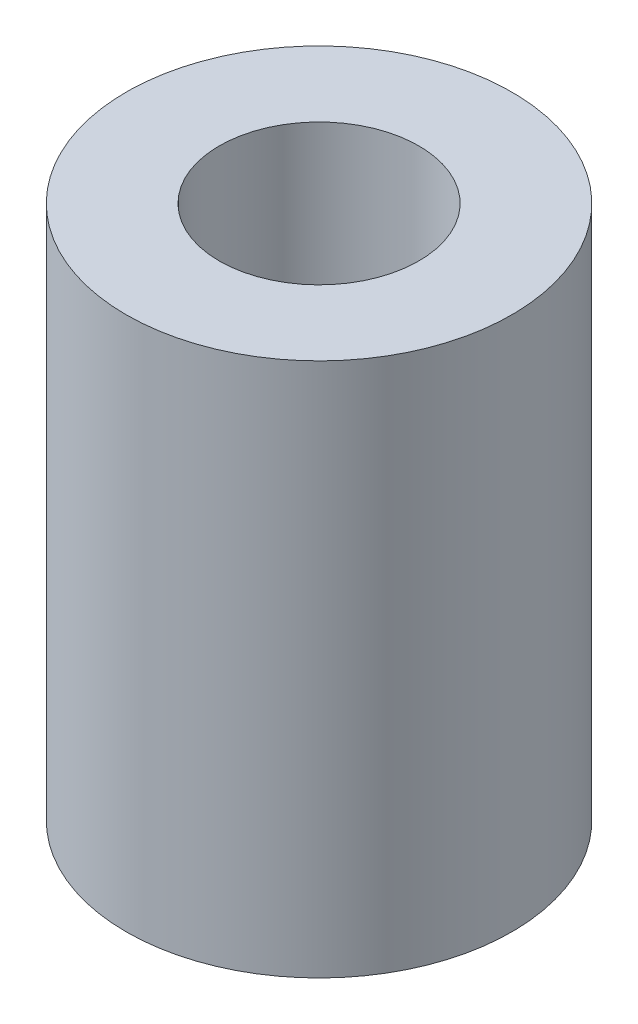
ISO-10303-21;
HEADER;
FILE_DESCRIPTION(('STEP AP214'),'2;1');
FILE_NAME('part.step','',(''),(''),'','','');
FILE_SCHEMA(('AUTOMOTIVE_DESIGN { 1 0 10303 214 1 1 1 1 }'));
ENDSEC;
DATA;
#1=APPLICATION_CONTEXT('core data for automotive mechanical design processes');
#2=APPLICATION_PROTOCOL_DEFINITION('international standard','automotive_design',2000,#1);
#3=PRODUCT_CONTEXT('',#1,'mechanical');
#4=PRODUCT('Part','Part','',(#3));
#5=PRODUCT_RELATED_PRODUCT_CATEGORY('part','',(#4));
#6=PRODUCT_DEFINITION_FORMATION('','',#4);
#7=PRODUCT_DEFINITION_CONTEXT('part definition',#1,'design');
#8=PRODUCT_DEFINITION('design','',#6,#7);
#9=PRODUCT_DEFINITION_SHAPE('','',#8);
#10=(LENGTH_UNIT() NAMED_UNIT(*) SI_UNIT(.MILLI.,.METRE.));
#11=(NAMED_UNIT(*) PLANE_ANGLE_UNIT() SI_UNIT($,.RADIAN.));
#12=(NAMED_UNIT(*) SI_UNIT($,.STERADIAN.) SOLID_ANGLE_UNIT());
#13=UNCERTAINTY_MEASURE_WITH_UNIT(LENGTH_MEASURE(1.E-05),#10,'distance_accuracy_value','');
#14=(GEOMETRIC_REPRESENTATION_CONTEXT(3) GLOBAL_UNCERTAINTY_ASSIGNED_CONTEXT((#13)) GLOBAL_UNIT_ASSIGNED_CONTEXT((#10,
#11,#12)) REPRESENTATION_CONTEXT('',''));
#15=CARTESIAN_POINT('',(0.,0.,0.));
#16=DIRECTION('',(0.,0.,1.));
#17=DIRECTION('',(1.,0.,0.));
#18=AXIS2_PLACEMENT_3D('',#15,#16,#17);
#19=CARTESIAN_POINT('',(0.,17.3482,0.));
#20=DIRECTION('',(0.,1.,0.));
#21=DIRECTION('',(0.,0.,1.));
#22=AXIS2_PLACEMENT_3D('',#19,#20,#21);
#23=PLANE('',#22);
#24=CARTESIAN_POINT('',(0.,17.3482,0.));
#25=DIRECTION('',(0.,1.,0.));
#26=DIRECTION('',(0.,0.,1.));
#27=AXIS2_PLACEMENT_3D('',#24,#25,#26);
#28=CIRCLE('',#27,6.2611);
#29=CARTESIAN_POINT('',(0.,17.3482,6.2611));
#30=VERTEX_POINT('',#29);
#31=EDGE_CURVE('E10',#30,#30,#28,.T.);
#32=ORIENTED_EDGE('',*,*,#31,.T.);
#33=EDGE_LOOP('',(#32));
#34=FACE_BOUND('',#33,.T.);
#35=CARTESIAN_POINT('',(0.,17.3482,0.));
#36=DIRECTION('',(0.,1.,0.));
#37=DIRECTION('',(0.,0.,1.));
#38=AXIS2_PLACEMENT_3D('',#35,#36,#37);
#39=CIRCLE('',#38,3.2385);
#40=CARTESIAN_POINT('',(0.,17.3482,3.2385));
#41=VERTEX_POINT('',#40);
#42=EDGE_CURVE('E49',#41,#41,#39,.T.);
#43=ORIENTED_EDGE('',*,*,#42,.F.);
#44=EDGE_LOOP('',(#43));
#45=FACE_BOUND('',#44,.T.);
#46=ADVANCED_FACE('F35',(#34,#45),#23,.T.);
#47=CARTESIAN_POINT('',(0.,0.,0.));
#48=DIRECTION('',(0.,1.,0.));
#49=DIRECTION('',(0.,0.,1.));
#50=AXIS2_PLACEMENT_3D('',#47,#48,#49);
#51=PLANE('',#50);
#52=CARTESIAN_POINT('',(0.,0.,0.));
#53=DIRECTION('',(0.,1.,0.));
#54=DIRECTION('',(0.,0.,1.));
#55=AXIS2_PLACEMENT_3D('',#52,#53,#54);
#56=CIRCLE('',#55,6.2611);
#57=CARTESIAN_POINT('',(0.,0.,6.2611));
#58=VERTEX_POINT('',#57);
#59=EDGE_CURVE('E39',#58,#58,#56,.T.);
#60=ORIENTED_EDGE('',*,*,#59,.F.);
#61=EDGE_LOOP('',(#60));
#62=FACE_BOUND('',#61,.T.);
#63=CARTESIAN_POINT('',(0.,0.,0.));
#64=DIRECTION('',(0.,1.,0.));
#65=DIRECTION('',(0.,0.,1.));
#66=AXIS2_PLACEMENT_3D('',#63,#64,#65);
#67=CIRCLE('',#66,3.2385);
#68=CARTESIAN_POINT('',(0.,0.,3.2385));
#69=VERTEX_POINT('',#68);
#70=EDGE_CURVE('E51',#69,#69,#67,.T.);
#71=ORIENTED_EDGE('',*,*,#70,.T.);
#72=EDGE_LOOP('',(#71));
#73=FACE_BOUND('',#72,.T.);
#74=ADVANCED_FACE('F62',(#62,#73),#51,.F.);
#75=CARTESIAN_POINT('',(0.,17.3482,0.));
#76=DIRECTION('',(0.,-1.,0.));
#77=DIRECTION('',(0.,0.,-1.));
#78=AXIS2_PLACEMENT_3D('',#75,#76,#77);
#79=CYLINDRICAL_SURFACE('',#78,6.2611);
#80=ORIENTED_EDGE('',*,*,#31,.F.);
#81=EDGE_LOOP('',(#80));
#82=FACE_BOUND('',#81,.T.);
#83=ORIENTED_EDGE('',*,*,#59,.T.);
#84=EDGE_LOOP('',(#83));
#85=FACE_BOUND('',#84,.T.);
#86=ADVANCED_FACE('F37',(#82,#85),#79,.T.);
#87=CARTESIAN_POINT('',(0.,17.3482,0.));
#88=DIRECTION('',(0.,-1.,0.));
#89=DIRECTION('',(0.,0.,-1.));
#90=AXIS2_PLACEMENT_3D('',#87,#88,#89);
#91=CYLINDRICAL_SURFACE('',#90,3.2385);
#92=ORIENTED_EDGE('',*,*,#42,.T.);
#93=EDGE_LOOP('',(#92));
#94=FACE_BOUND('',#93,.T.);
#95=ORIENTED_EDGE('',*,*,#70,.F.);
#96=EDGE_LOOP('',(#95));
#97=FACE_BOUND('',#96,.T.);
#98=ADVANCED_FACE('F58',(#94,#97),#91,.F.);
#99=CLOSED_SHELL('',(#46,#74,#86,#98));
#100=MANIFOLD_SOLID_BREP('B2',#99);
#101=ADVANCED_BREP_SHAPE_REPRESENTATION('',(#18,#100),#14);
#102=SHAPE_DEFINITION_REPRESENTATION(#9,#101);
ENDSEC;
END-ISO-10303-21;
